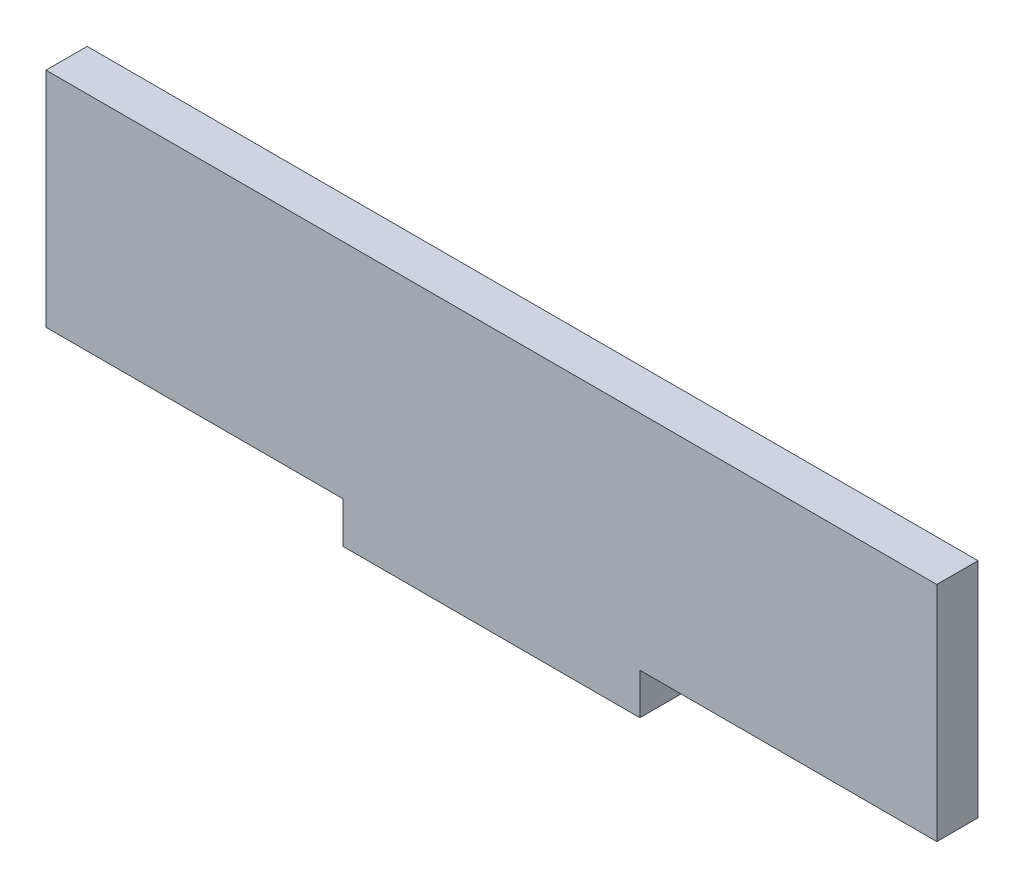
ISO-10303-21;
HEADER;
FILE_DESCRIPTION(('STEP AP214'),'2;1');
FILE_NAME('part.step','',(''),(''),'','','');
FILE_SCHEMA(('AUTOMOTIVE_DESIGN { 1 0 10303 214 1 1 1 1 }'));
ENDSEC;
DATA;
#1=APPLICATION_CONTEXT('core data for automotive mechanical design processes');
#2=APPLICATION_PROTOCOL_DEFINITION('international standard','automotive_design',2000,#1);
#3=PRODUCT_CONTEXT('',#1,'mechanical');
#4=PRODUCT('Part','Part','',(#3));
#5=PRODUCT_RELATED_PRODUCT_CATEGORY('part','',(#4));
#6=PRODUCT_DEFINITION_FORMATION('','',#4);
#7=PRODUCT_DEFINITION_CONTEXT('part definition',#1,'design');
#8=PRODUCT_DEFINITION('design','',#6,#7);
#9=PRODUCT_DEFINITION_SHAPE('','',#8);
#10=(LENGTH_UNIT() NAMED_UNIT(*) SI_UNIT(.MILLI.,.METRE.));
#11=(NAMED_UNIT(*) PLANE_ANGLE_UNIT() SI_UNIT($,.RADIAN.));
#12=(NAMED_UNIT(*) SI_UNIT($,.STERADIAN.) SOLID_ANGLE_UNIT());
#13=UNCERTAINTY_MEASURE_WITH_UNIT(LENGTH_MEASURE(1.E-05),#10,'distance_accuracy_value','');
#14=(GEOMETRIC_REPRESENTATION_CONTEXT(3) GLOBAL_UNCERTAINTY_ASSIGNED_CONTEXT((#13)) GLOBAL_UNIT_ASSIGNED_CONTEXT((#10,
#11,#12)) REPRESENTATION_CONTEXT('',''));
#15=CARTESIAN_POINT('',(0.,0.,0.));
#16=DIRECTION('',(0.,0.,1.));
#17=DIRECTION('',(1.,0.,0.));
#18=AXIS2_PLACEMENT_3D('',#15,#16,#17);
#19=CARTESIAN_POINT('',(0.,0.,4.699));
#20=DIRECTION('',(1.,0.,0.));
#21=DIRECTION('',(0.,0.,-1.));
#22=AXIS2_PLACEMENT_3D('',#19,#20,#21);
#23=PLANE('',#22);
#24=DIRECTION('',(0.,-1.,0.));
#25=VECTOR('',#24,1.);
#26=CARTESIAN_POINT('',(0.,0.,0.));
#27=LINE('',#26,#25);
#28=CARTESIAN_POINT('',(0.,25.4,0.));
#29=VERTEX_POINT('',#28);
#30=CARTESIAN_POINT('',(0.,0.,0.));
#31=VERTEX_POINT('',#30);
#32=EDGE_CURVE('E128',#29,#31,#27,.T.);
#33=ORIENTED_EDGE('',*,*,#32,.T.);
#34=DIRECTION('',(0.,0.,-1.));
#35=VECTOR('',#34,1.);
#36=CARTESIAN_POINT('',(0.,0.,4.699));
#37=LINE('',#36,#35);
#38=CARTESIAN_POINT('',(0.,0.,4.699));
#39=VERTEX_POINT('',#38);
#40=EDGE_CURVE('E11',#39,#31,#37,.T.);
#41=ORIENTED_EDGE('',*,*,#40,.F.);
#42=DIRECTION('',(0.,-1.,0.));
#43=VECTOR('',#42,1.);
#44=CARTESIAN_POINT('',(0.,0.,4.699));
#45=LINE('',#44,#43);
#46=CARTESIAN_POINT('',(0.,25.4,4.699));
#47=VERTEX_POINT('',#46);
#48=EDGE_CURVE('E142',#47,#39,#45,.T.);
#49=ORIENTED_EDGE('',*,*,#48,.F.);
#50=DIRECTION('',(0.,0.,-1.));
#51=VECTOR('',#50,1.);
#52=CARTESIAN_POINT('',(0.,25.4,4.699));
#53=LINE('',#52,#51);
#54=EDGE_CURVE('E124',#47,#29,#53,.T.);
#55=ORIENTED_EDGE('',*,*,#54,.T.);
#56=EDGE_LOOP('',(#33,#41,#49,#55));
#57=FACE_BOUND('',#56,.T.);
#58=ADVANCED_FACE('F32',(#57),#23,.F.);
#59=CARTESIAN_POINT('',(0.,0.,4.699));
#60=DIRECTION('',(0.,1.,0.));
#61=DIRECTION('',(0.,0.,1.));
#62=AXIS2_PLACEMENT_3D('',#59,#60,#61);
#63=PLANE('',#62);
#64=DIRECTION('',(1.,0.,0.));
#65=VECTOR('',#64,1.);
#66=CARTESIAN_POINT('',(0.,0.,0.));
#67=LINE('',#66,#65);
#68=CARTESIAN_POINT('',(33.8666666666667,0.,0.));
#69=VERTEX_POINT('',#68);
#70=EDGE_CURVE('E131',#31,#69,#67,.T.);
#71=ORIENTED_EDGE('',*,*,#70,.T.);
#72=DIRECTION('',(0.,0.,-1.));
#73=VECTOR('',#72,1.);
#74=CARTESIAN_POINT('',(33.8666666666667,0.,4.699));
#75=LINE('',#74,#73);
#76=CARTESIAN_POINT('',(33.8666666666667,0.,4.699));
#77=VERTEX_POINT('',#76);
#78=EDGE_CURVE('E40',#77,#69,#75,.T.);
#79=ORIENTED_EDGE('',*,*,#78,.F.);
#80=DIRECTION('',(1.,0.,0.));
#81=VECTOR('',#80,1.);
#82=CARTESIAN_POINT('',(0.,0.,4.699));
#83=LINE('',#82,#81);
#84=EDGE_CURVE('E91',#39,#77,#83,.T.);
#85=ORIENTED_EDGE('',*,*,#84,.F.);
#86=ORIENTED_EDGE('',*,*,#40,.T.);
#87=EDGE_LOOP('',(#71,#79,#85,#86));
#88=FACE_BOUND('',#87,.T.);
#89=ADVANCED_FACE('F177',(#88),#63,.F.);
#90=CARTESIAN_POINT('',(33.8666666666667,0.,4.699));
#91=DIRECTION('',(1.,0.,0.));
#92=DIRECTION('',(0.,1.,0.));
#93=AXIS2_PLACEMENT_3D('',#90,#91,#92);
#94=PLANE('',#93);
#95=DIRECTION('',(0.,-1.,0.));
#96=VECTOR('',#95,1.);
#97=CARTESIAN_POINT('',(33.8666666666667,0.,0.));
#98=LINE('',#97,#96);
#99=CARTESIAN_POINT('',(33.8666666666667,-4.699,0.));
#100=VERTEX_POINT('',#99);
#101=EDGE_CURVE('E133',#69,#100,#98,.T.);
#102=ORIENTED_EDGE('',*,*,#101,.T.);
#103=DIRECTION('',(0.,0.,-1.));
#104=VECTOR('',#103,1.);
#105=CARTESIAN_POINT('',(33.8666666666667,-4.699,4.699));
#106=LINE('',#105,#104);
#107=CARTESIAN_POINT('',(33.8666666666667,-4.699,4.699));
#108=VERTEX_POINT('',#107);
#109=EDGE_CURVE('E149',#108,#100,#106,.T.);
#110=ORIENTED_EDGE('',*,*,#109,.F.);
#111=DIRECTION('',(0.,-1.,0.));
#112=VECTOR('',#111,1.);
#113=CARTESIAN_POINT('',(33.8666666666667,0.,4.699));
#114=LINE('',#113,#112);
#115=EDGE_CURVE('E157',#77,#108,#114,.T.);
#116=ORIENTED_EDGE('',*,*,#115,.F.);
#117=ORIENTED_EDGE('',*,*,#78,.T.);
#118=EDGE_LOOP('',(#102,#110,#116,#117));
#119=FACE_BOUND('',#118,.T.);
#120=ADVANCED_FACE('F155',(#119),#94,.F.);
#121=CARTESIAN_POINT('',(33.8666666666667,-4.699,4.699));
#122=DIRECTION('',(0.,1.,0.));
#123=DIRECTION('',(0.,0.,1.));
#124=AXIS2_PLACEMENT_3D('',#121,#122,#123);
#125=PLANE('',#124);
#126=DIRECTION('',(1.,0.,0.));
#127=VECTOR('',#126,1.);
#128=CARTESIAN_POINT('',(33.8666666666667,-4.699,0.));
#129=LINE('',#128,#127);
#130=CARTESIAN_POINT('',(67.7333333333333,-4.699,0.));
#131=VERTEX_POINT('',#130);
#132=EDGE_CURVE('E135',#100,#131,#129,.T.);
#133=ORIENTED_EDGE('',*,*,#132,.T.);
#134=DIRECTION('',(0.,0.,-1.));
#135=VECTOR('',#134,1.);
#136=CARTESIAN_POINT('',(67.7333333333333,-4.699,4.699));
#137=LINE('',#136,#135);
#138=CARTESIAN_POINT('',(67.7333333333333,-4.699,4.699));
#139=VERTEX_POINT('',#138);
#140=EDGE_CURVE('E146',#139,#131,#137,.T.);
#141=ORIENTED_EDGE('',*,*,#140,.F.);
#142=DIRECTION('',(1.,0.,0.));
#143=VECTOR('',#142,1.);
#144=CARTESIAN_POINT('',(33.8666666666667,-4.699,4.699));
#145=LINE('',#144,#143);
#146=EDGE_CURVE('E169',#108,#139,#145,.T.);
#147=ORIENTED_EDGE('',*,*,#146,.F.);
#148=ORIENTED_EDGE('',*,*,#109,.T.);
#149=EDGE_LOOP('',(#133,#141,#147,#148));
#150=FACE_BOUND('',#149,.T.);
#151=ADVANCED_FACE('F165',(#150),#125,.F.);
#152=CARTESIAN_POINT('',(67.7333333333333,0.,4.699));
#153=DIRECTION('',(-1.,0.,0.));
#154=DIRECTION('',(0.,-1.,0.));
#155=AXIS2_PLACEMENT_3D('',#152,#153,#154);
#156=PLANE('',#155);
#157=DIRECTION('',(0.,1.,0.));
#158=VECTOR('',#157,1.);
#159=CARTESIAN_POINT('',(67.7333333333333,0.,0.));
#160=LINE('',#159,#158);
#161=CARTESIAN_POINT('',(67.7333333333333,0.,0.));
#162=VERTEX_POINT('',#161);
#163=EDGE_CURVE('E137',#131,#162,#160,.T.);
#164=ORIENTED_EDGE('',*,*,#163,.T.);
#165=DIRECTION('',(0.,0.,-1.));
#166=VECTOR('',#165,1.);
#167=CARTESIAN_POINT('',(67.7333333333333,0.,4.699));
#168=LINE('',#167,#166);
#169=CARTESIAN_POINT('',(67.7333333333333,0.,4.699));
#170=VERTEX_POINT('',#169);
#171=EDGE_CURVE('E119',#170,#162,#168,.T.);
#172=ORIENTED_EDGE('',*,*,#171,.F.);
#173=DIRECTION('',(0.,1.,0.));
#174=VECTOR('',#173,1.);
#175=CARTESIAN_POINT('',(67.7333333333333,0.,4.699));
#176=LINE('',#175,#174);
#177=EDGE_CURVE('E110',#139,#170,#176,.T.);
#178=ORIENTED_EDGE('',*,*,#177,.F.);
#179=ORIENTED_EDGE('',*,*,#140,.T.);
#180=EDGE_LOOP('',(#164,#172,#178,#179));
#181=FACE_BOUND('',#180,.T.);
#182=ADVANCED_FACE('F168',(#181),#156,.F.);
#183=CARTESIAN_POINT('',(67.7333333333333,0.,4.699));
#184=DIRECTION('',(0.,1.,0.));
#185=DIRECTION('',(0.,0.,1.));
#186=AXIS2_PLACEMENT_3D('',#183,#184,#185);
#187=PLANE('',#186);
#188=DIRECTION('',(1.,0.,0.));
#189=VECTOR('',#188,1.);
#190=CARTESIAN_POINT('',(67.7333333333333,0.,0.));
#191=LINE('',#190,#189);
#192=CARTESIAN_POINT('',(101.6,0.,0.));
#193=VERTEX_POINT('',#192);
#194=EDGE_CURVE('E118',#162,#193,#191,.T.);
#195=ORIENTED_EDGE('',*,*,#194,.T.);
#196=DIRECTION('',(0.,0.,-1.));
#197=VECTOR('',#196,1.);
#198=CARTESIAN_POINT('',(101.6,0.,4.699));
#199=LINE('',#198,#197);
#200=CARTESIAN_POINT('',(101.6,0.,4.699));
#201=VERTEX_POINT('',#200);
#202=EDGE_CURVE('E115',#201,#193,#199,.T.);
#203=ORIENTED_EDGE('',*,*,#202,.F.);
#204=DIRECTION('',(1.,0.,0.));
#205=VECTOR('',#204,1.);
#206=CARTESIAN_POINT('',(67.7333333333333,0.,4.699));
#207=LINE('',#206,#205);
#208=EDGE_CURVE('E104',#170,#201,#207,.T.);
#209=ORIENTED_EDGE('',*,*,#208,.F.);
#210=ORIENTED_EDGE('',*,*,#171,.T.);
#211=EDGE_LOOP('',(#195,#203,#209,#210));
#212=FACE_BOUND('',#211,.T.);
#213=ADVANCED_FACE('F116',(#212),#187,.F.);
#214=CARTESIAN_POINT('',(101.6,0.,4.699));
#215=DIRECTION('',(-1.,0.,0.));
#216=DIRECTION('',(0.,0.,1.));
#217=AXIS2_PLACEMENT_3D('',#214,#215,#216);
#218=PLANE('',#217);
#219=DIRECTION('',(0.,1.,0.));
#220=VECTOR('',#219,1.);
#221=CARTESIAN_POINT('',(101.6,0.,0.));
#222=LINE('',#221,#220);
#223=CARTESIAN_POINT('',(101.6,25.4,0.));
#224=VERTEX_POINT('',#223);
#225=EDGE_CURVE('E77',#193,#224,#222,.T.);
#226=ORIENTED_EDGE('',*,*,#225,.T.);
#227=DIRECTION('',(0.,0.,-1.));
#228=VECTOR('',#227,1.);
#229=CARTESIAN_POINT('',(101.6,25.4,4.699));
#230=LINE('',#229,#228);
#231=CARTESIAN_POINT('',(101.6,25.4,4.699));
#232=VERTEX_POINT('',#231);
#233=EDGE_CURVE('E120',#232,#224,#230,.T.);
#234=ORIENTED_EDGE('',*,*,#233,.F.);
#235=DIRECTION('',(0.,1.,0.));
#236=VECTOR('',#235,1.);
#237=CARTESIAN_POINT('',(101.6,0.,4.699));
#238=LINE('',#237,#236);
#239=EDGE_CURVE('E108',#201,#232,#238,.T.);
#240=ORIENTED_EDGE('',*,*,#239,.F.);
#241=ORIENTED_EDGE('',*,*,#202,.T.);
#242=EDGE_LOOP('',(#226,#234,#240,#241));
#243=FACE_BOUND('',#242,.T.);
#244=ADVANCED_FACE('F122',(#243),#218,.F.);
#245=CARTESIAN_POINT('',(0.,25.4,4.699));
#246=DIRECTION('',(0.,-1.,0.));
#247=DIRECTION('',(0.,0.,-1.));
#248=AXIS2_PLACEMENT_3D('',#245,#246,#247);
#249=PLANE('',#248);
#250=DIRECTION('',(-1.,0.,0.));
#251=VECTOR('',#250,1.);
#252=CARTESIAN_POINT('',(0.,25.4,0.));
#253=LINE('',#252,#251);
#254=EDGE_CURVE('E83',#224,#29,#253,.T.);
#255=ORIENTED_EDGE('',*,*,#254,.T.);
#256=ORIENTED_EDGE('',*,*,#54,.F.);
#257=DIRECTION('',(-1.,0.,0.));
#258=VECTOR('',#257,1.);
#259=CARTESIAN_POINT('',(0.,25.4,4.699));
#260=LINE('',#259,#258);
#261=EDGE_CURVE('E48',#232,#47,#260,.T.);
#262=ORIENTED_EDGE('',*,*,#261,.F.);
#263=ORIENTED_EDGE('',*,*,#233,.T.);
#264=EDGE_LOOP('',(#255,#256,#262,#263));
#265=FACE_BOUND('',#264,.T.);
#266=ADVANCED_FACE('F193',(#265),#249,.F.);
#267=CARTESIAN_POINT('',(0.,0.,4.699));
#268=DIRECTION('',(0.,0.,-1.));
#269=DIRECTION('',(-1.,0.,0.));
#270=AXIS2_PLACEMENT_3D('',#267,#268,#269);
#271=PLANE('',#270);
#272=ORIENTED_EDGE('',*,*,#48,.T.);
#273=ORIENTED_EDGE('',*,*,#84,.T.);
#274=ORIENTED_EDGE('',*,*,#115,.T.);
#275=ORIENTED_EDGE('',*,*,#146,.T.);
#276=ORIENTED_EDGE('',*,*,#177,.T.);
#277=ORIENTED_EDGE('',*,*,#208,.T.);
#278=ORIENTED_EDGE('',*,*,#239,.T.);
#279=ORIENTED_EDGE('',*,*,#261,.T.);
#280=EDGE_LOOP('',(#272,#273,#274,#275,#276,#277,#278,#279));
#281=FACE_BOUND('',#280,.T.);
#282=ADVANCED_FACE('F106',(#281),#271,.F.);
#283=CARTESIAN_POINT('',(0.,0.,0.));
#284=DIRECTION('',(0.,0.,-1.));
#285=DIRECTION('',(-1.,0.,0.));
#286=AXIS2_PLACEMENT_3D('',#283,#284,#285);
#287=PLANE('',#286);
#288=ORIENTED_EDGE('',*,*,#32,.F.);
#289=ORIENTED_EDGE('',*,*,#254,.F.);
#290=ORIENTED_EDGE('',*,*,#225,.F.);
#291=ORIENTED_EDGE('',*,*,#194,.F.);
#292=ORIENTED_EDGE('',*,*,#163,.F.);
#293=ORIENTED_EDGE('',*,*,#132,.F.);
#294=ORIENTED_EDGE('',*,*,#101,.F.);
#295=ORIENTED_EDGE('',*,*,#70,.F.);
#296=EDGE_LOOP('',(#288,#289,#290,#291,#292,#293,#294,#295));
#297=FACE_BOUND('',#296,.T.);
#298=ADVANCED_FACE('F161',(#297),#287,.T.);
#299=CLOSED_SHELL('',(#58,#89,#120,#151,#182,#213,#244,#266,#282,#298));
#300=MANIFOLD_SOLID_BREP('B2',#299);
#301=ADVANCED_BREP_SHAPE_REPRESENTATION('',(#18,#300),#14);
#302=SHAPE_DEFINITION_REPRESENTATION(#9,#301);
ENDSEC;
END-ISO-10303-21;
